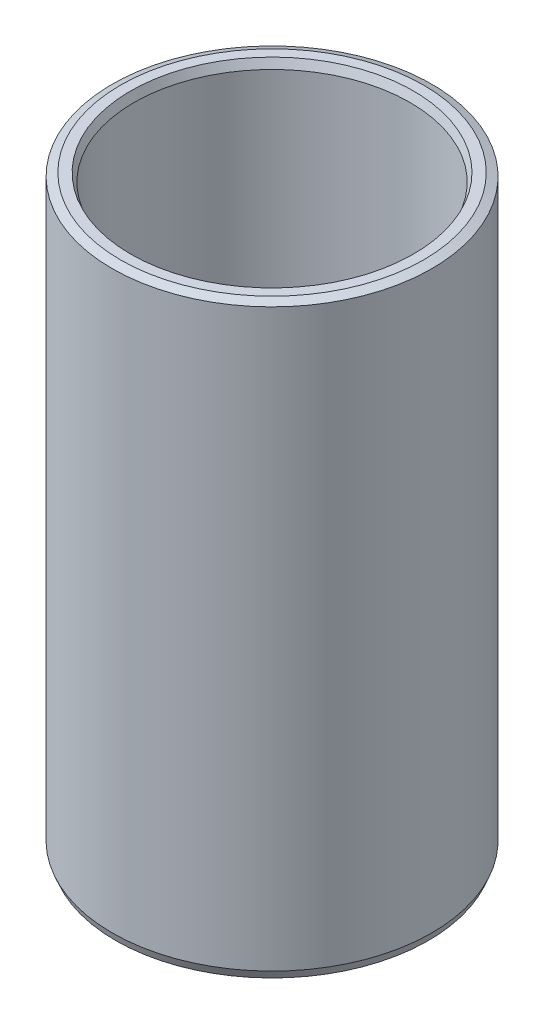
ISO-10303-21;
HEADER;
FILE_DESCRIPTION(('STEP AP214'),'2;1');
FILE_NAME('part.step','',(''),(''),'','','');
FILE_SCHEMA(('AUTOMOTIVE_DESIGN { 1 0 10303 214 1 1 1 1 }'));
ENDSEC;
DATA;
#1=APPLICATION_CONTEXT('core data for automotive mechanical design processes');
#2=APPLICATION_PROTOCOL_DEFINITION('international standard','automotive_design',2000,#1);
#3=PRODUCT_CONTEXT('',#1,'mechanical');
#4=PRODUCT('Part','Part','',(#3));
#5=PRODUCT_RELATED_PRODUCT_CATEGORY('part','',(#4));
#6=PRODUCT_DEFINITION_FORMATION('','',#4);
#7=PRODUCT_DEFINITION_CONTEXT('part definition',#1,'design');
#8=PRODUCT_DEFINITION('design','',#6,#7);
#9=PRODUCT_DEFINITION_SHAPE('','',#8);
#10=(LENGTH_UNIT() NAMED_UNIT(*) SI_UNIT(.MILLI.,.METRE.));
#11=(NAMED_UNIT(*) PLANE_ANGLE_UNIT() SI_UNIT($,.RADIAN.));
#12=(NAMED_UNIT(*) SI_UNIT($,.STERADIAN.) SOLID_ANGLE_UNIT());
#13=UNCERTAINTY_MEASURE_WITH_UNIT(LENGTH_MEASURE(1.E-05),#10,'distance_accuracy_value','');
#14=(GEOMETRIC_REPRESENTATION_CONTEXT(3) GLOBAL_UNCERTAINTY_ASSIGNED_CONTEXT((#13)) GLOBAL_UNIT_ASSIGNED_CONTEXT((#10,
#11,#12)) REPRESENTATION_CONTEXT('',''));
#15=CARTESIAN_POINT('',(0.,0.,0.));
#16=DIRECTION('',(0.,0.,1.));
#17=DIRECTION('',(1.,0.,0.));
#18=AXIS2_PLACEMENT_3D('',#15,#16,#17);
#19=CARTESIAN_POINT('',(0.,220.382200529837,0.));
#20=DIRECTION('',(0.,-1.,0.));
#21=DIRECTION('',(0.,0.,-1.));
#22=AXIS2_PLACEMENT_3D('',#19,#20,#21);
#23=CYLINDRICAL_SURFACE('',#22,60.);
#24=CARTESIAN_POINT('',(0.,3.12817113196864,0.));
#25=DIRECTION('',(0.,1.,0.));
#26=DIRECTION('',(0.,0.,1.));
#27=AXIS2_PLACEMENT_3D('',#24,#25,#26);
#28=CIRCLE('',#27,60.);
#29=CARTESIAN_POINT('',(0.,3.12817113196864,60.));
#30=VERTEX_POINT('',#29);
#31=EDGE_CURVE('E10',#30,#30,#28,.T.);
#32=ORIENTED_EDGE('',*,*,#31,.T.);
#33=EDGE_LOOP('',(#32));
#34=FACE_BOUND('',#33,.T.);
#35=CARTESIAN_POINT('',(0.,219.115997371865,0.));
#36=DIRECTION('',(0.,1.,0.));
#37=DIRECTION('',(0.,0.,1.));
#38=AXIS2_PLACEMENT_3D('',#35,#36,#37);
#39=CIRCLE('',#38,60.);
#40=CARTESIAN_POINT('',(0.,219.115997371865,60.));
#41=VERTEX_POINT('',#40);
#42=EDGE_CURVE('E50',#41,#41,#39,.F.);
#43=ORIENTED_EDGE('',*,*,#42,.T.);
#44=EDGE_LOOP('',(#43));
#45=FACE_BOUND('',#44,.T.);
#46=ADVANCED_FACE('F39',(#34,#45),#23,.T.);
#47=CARTESIAN_POINT('',(0.,220.382200529837,0.));
#48=DIRECTION('',(0.,1.,0.));
#49=DIRECTION('',(0.,0.,1.));
#50=AXIS2_PLACEMENT_3D('',#47,#48,#49);
#51=PLANE('',#50);
#52=CARTESIAN_POINT('',(0.,220.382200529837,0.));
#53=DIRECTION('',(0.,1.,0.));
#54=DIRECTION('',(0.,0.,1.));
#55=AXIS2_PLACEMENT_3D('',#52,#53,#54);
#56=CIRCLE('',#55,53.0864490661258);
#57=CARTESIAN_POINT('',(0.,220.382200529837,53.0864490661258));
#58=VERTEX_POINT('',#57);
#59=EDGE_CURVE('E58',#58,#58,#56,.F.);
#60=ORIENTED_EDGE('',*,*,#59,.T.);
#61=EDGE_LOOP('',(#60));
#62=FACE_BOUND('',#61,.T.);
#63=CARTESIAN_POINT('',(0.,220.382200529837,0.));
#64=DIRECTION('',(0.,1.,0.));
#65=DIRECTION('',(0.,0.,1.));
#66=AXIS2_PLACEMENT_3D('',#63,#64,#65);
#67=CIRCLE('',#66,56.8718288680315);
#68=CARTESIAN_POINT('',(0.,220.382200529837,56.8718288680315));
#69=VERTEX_POINT('',#68);
#70=EDGE_CURVE('E61',#69,#69,#67,.T.);
#71=ORIENTED_EDGE('',*,*,#70,.T.);
#72=EDGE_LOOP('',(#71));
#73=FACE_BOUND('',#72,.T.);
#74=ADVANCED_FACE('F88',(#62,#73),#51,.T.);
#75=CARTESIAN_POINT('',(0.,0.,0.));
#76=DIRECTION('',(0.,1.,0.));
#77=DIRECTION('',(0.,0.,1.));
#78=AXIS2_PLACEMENT_3D('',#75,#76,#77);
#79=PLANE('',#78);
#80=CARTESIAN_POINT('',(0.,0.,0.));
#81=DIRECTION('',(0.,1.,0.));
#82=DIRECTION('',(0.,0.,1.));
#83=AXIS2_PLACEMENT_3D('',#80,#81,#82);
#84=CIRCLE('',#83,54.9484170401224);
#85=CARTESIAN_POINT('',(0.,0.,54.9484170401224));
#86=VERTEX_POINT('',#85);
#87=EDGE_CURVE('E51',#86,#86,#84,.T.);
#88=ORIENTED_EDGE('',*,*,#87,.T.);
#89=EDGE_LOOP('',(#88));
#90=FACE_BOUND('',#89,.T.);
#91=CARTESIAN_POINT('',(0.,0.,0.));
#92=DIRECTION('',(0.,1.,0.));
#93=DIRECTION('',(0.,0.,1.));
#94=AXIS2_PLACEMENT_3D('',#91,#92,#93);
#95=CIRCLE('',#94,58.7337968420279);
#96=CARTESIAN_POINT('',(0.,0.,58.7337968420279));
#97=VERTEX_POINT('',#96);
#98=EDGE_CURVE('E54',#97,#97,#95,.F.);
#99=ORIENTED_EDGE('',*,*,#98,.T.);
#100=EDGE_LOOP('',(#99));
#101=FACE_BOUND('',#100,.T.);
#102=ADVANCED_FACE('F83',(#90,#101),#79,.F.);
#103=CARTESIAN_POINT('',(0.,220.382200529837,0.));
#104=DIRECTION('',(0.,-1.,0.));
#105=DIRECTION('',(0.,0.,-1.));
#106=AXIS2_PLACEMENT_3D('',#103,#104,#105);
#107=CYLINDRICAL_SURFACE('',#106,51.8202459081538);
#108=CARTESIAN_POINT('',(0.,217.254029397869,0.));
#109=DIRECTION('',(0.,1.,0.));
#110=DIRECTION('',(0.,0.,1.));
#111=AXIS2_PLACEMENT_3D('',#108,#109,#110);
#112=CIRCLE('',#111,51.8202459081538);
#113=CARTESIAN_POINT('',(0.,217.254029397869,51.8202459081538));
#114=VERTEX_POINT('',#113);
#115=EDGE_CURVE('E67',#114,#114,#112,.T.);
#116=ORIENTED_EDGE('',*,*,#115,.T.);
#117=EDGE_LOOP('',(#116));
#118=FACE_BOUND('',#117,.T.);
#119=CARTESIAN_POINT('',(0.,1.26620315797205,0.));
#120=DIRECTION('',(0.,1.,0.));
#121=DIRECTION('',(0.,0.,1.));
#122=AXIS2_PLACEMENT_3D('',#119,#120,#121);
#123=CIRCLE('',#122,51.8202459081538);
#124=CARTESIAN_POINT('',(0.,1.26620315797205,51.8202459081538));
#125=VERTEX_POINT('',#124);
#126=EDGE_CURVE('E69',#125,#125,#123,.F.);
#127=ORIENTED_EDGE('',*,*,#126,.T.);
#128=EDGE_LOOP('',(#127));
#129=FACE_BOUND('',#128,.T.);
#130=ADVANCED_FACE('F71',(#118,#129),#107,.F.);
#131=CARTESIAN_POINT('',(0.,217.254029397869,0.));
#132=DIRECTION('',(0.,1.,0.));
#133=DIRECTION('',(0.,0.,1.));
#134=AXIS2_PLACEMENT_3D('',#131,#132,#133);
#135=CONICAL_SURFACE('',#134,51.8202459081538,0.384615331562678);
#136=ORIENTED_EDGE('',*,*,#59,.F.);
#137=EDGE_LOOP('',(#136));
#138=FACE_BOUND('',#137,.T.);
#139=ORIENTED_EDGE('',*,*,#115,.F.);
#140=EDGE_LOOP('',(#139));
#141=FACE_BOUND('',#140,.T.);
#142=ADVANCED_FACE('F77',(#138,#141),#135,.F.);
#143=CARTESIAN_POINT('',(0.,0.,0.));
#144=DIRECTION('',(0.,-1.,0.));
#145=DIRECTION('',(0.,0.,-1.));
#146=AXIS2_PLACEMENT_3D('',#143,#144,#145);
#147=CONICAL_SURFACE('',#146,54.9484170401224,1.18618099523221);
#148=ORIENTED_EDGE('',*,*,#126,.F.);
#149=EDGE_LOOP('',(#148));
#150=FACE_BOUND('',#149,.T.);
#151=ORIENTED_EDGE('',*,*,#87,.F.);
#152=EDGE_LOOP('',(#151));
#153=FACE_BOUND('',#152,.T.);
#154=ADVANCED_FACE('F73',(#150,#153),#147,.F.);
#155=CARTESIAN_POINT('',(0.,3.12817113196864,0.));
#156=DIRECTION('',(0.,1.,0.));
#157=DIRECTION('',(0.,0.,1.));
#158=AXIS2_PLACEMENT_3D('',#155,#156,#157);
#159=CONICAL_SURFACE('',#158,60.,0.384615331562685);
#160=ORIENTED_EDGE('',*,*,#98,.F.);
#161=EDGE_LOOP('',(#160));
#162=FACE_BOUND('',#161,.T.);
#163=ORIENTED_EDGE('',*,*,#31,.F.);
#164=EDGE_LOOP('',(#163));
#165=FACE_BOUND('',#164,.T.);
#166=ADVANCED_FACE('F76',(#162,#165),#159,.T.);
#167=CARTESIAN_POINT('',(0.,220.382200529837,0.));
#168=DIRECTION('',(0.,-1.,0.));
#169=DIRECTION('',(0.,0.,-1.));
#170=AXIS2_PLACEMENT_3D('',#167,#168,#169);
#171=CONICAL_SURFACE('',#170,56.8718288680315,1.18618099523221);
#172=ORIENTED_EDGE('',*,*,#42,.F.);
#173=EDGE_LOOP('',(#172));
#174=FACE_BOUND('',#173,.T.);
#175=ORIENTED_EDGE('',*,*,#70,.F.);
#176=EDGE_LOOP('',(#175));
#177=FACE_BOUND('',#176,.T.);
#178=ADVANCED_FACE('F45',(#174,#177),#171,.T.);
#179=CLOSED_SHELL('',(#46,#74,#102,#130,#142,#154,#166,#178));
#180=MANIFOLD_SOLID_BREP('B2',#179);
#181=ADVANCED_BREP_SHAPE_REPRESENTATION('',(#18,#180),#14);
#182=SHAPE_DEFINITION_REPRESENTATION(#9,#181);
ENDSEC;
END-ISO-10303-21;
